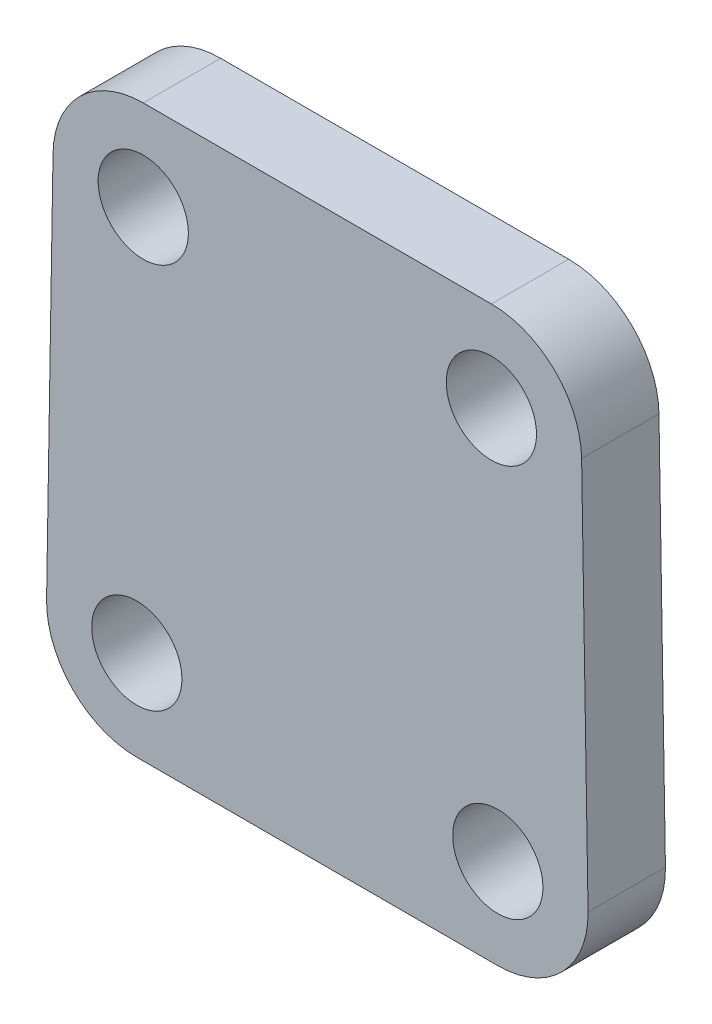
ISO-10303-21;
HEADER;
FILE_DESCRIPTION(('STEP AP214'),'2;1');
FILE_NAME('part.step','',(''),(''),'','','');
FILE_SCHEMA(('AUTOMOTIVE_DESIGN { 1 0 10303 214 1 1 1 1 }'));
ENDSEC;
DATA;
#1=APPLICATION_CONTEXT('core data for automotive mechanical design processes');
#2=APPLICATION_PROTOCOL_DEFINITION('international standard','automotive_design',2000,#1);
#3=PRODUCT_CONTEXT('',#1,'mechanical');
#4=PRODUCT('Part','Part','',(#3));
#5=PRODUCT_RELATED_PRODUCT_CATEGORY('part','',(#4));
#6=PRODUCT_DEFINITION_FORMATION('','',#4);
#7=PRODUCT_DEFINITION_CONTEXT('part definition',#1,'design');
#8=PRODUCT_DEFINITION('design','',#6,#7);
#9=PRODUCT_DEFINITION_SHAPE('','',#8);
#10=(LENGTH_UNIT() NAMED_UNIT(*) SI_UNIT(.MILLI.,.METRE.));
#11=(NAMED_UNIT(*) PLANE_ANGLE_UNIT() SI_UNIT($,.RADIAN.));
#12=(NAMED_UNIT(*) SI_UNIT($,.STERADIAN.) SOLID_ANGLE_UNIT());
#13=UNCERTAINTY_MEASURE_WITH_UNIT(LENGTH_MEASURE(1.E-05),#10,'distance_accuracy_value','');
#14=(GEOMETRIC_REPRESENTATION_CONTEXT(3) GLOBAL_UNCERTAINTY_ASSIGNED_CONTEXT((#13)) GLOBAL_UNIT_ASSIGNED_CONTEXT((#10,
#11,#12)) REPRESENTATION_CONTEXT('',''));
#15=CARTESIAN_POINT('',(0.,0.,0.));
#16=DIRECTION('',(0.,0.,1.));
#17=DIRECTION('',(1.,0.,0.));
#18=AXIS2_PLACEMENT_3D('',#15,#16,#17);
#19=CARTESIAN_POINT('',(0.,-7.3,3.));
#20=DIRECTION('',(0.,-1.,0.));
#21=DIRECTION('',(0.,0.,-1.));
#22=AXIS2_PLACEMENT_3D('',#19,#20,#21);
#23=PLANE('',#22);
#24=DIRECTION('',(-1.,0.,0.));
#25=VECTOR('',#24,1.);
#26=CARTESIAN_POINT('',(0.,-7.3,0.));
#27=LINE('',#26,#25);
#28=CARTESIAN_POINT('',(6.99952033899474,-7.3,0.));
#29=VERTEX_POINT('',#28);
#30=CARTESIAN_POINT('',(-6.99952033899473,-7.3,0.));
#31=VERTEX_POINT('',#30);
#32=EDGE_CURVE('E117',#29,#31,#27,.T.);
#33=ORIENTED_EDGE('',*,*,#32,.F.);
#34=DIRECTION('',(0.,0.,-1.));
#35=VECTOR('',#34,1.);
#36=CARTESIAN_POINT('',(6.99952033899474,-7.3,3.));
#37=LINE('',#36,#35);
#38=CARTESIAN_POINT('',(6.99952033899474,-7.3,3.));
#39=VERTEX_POINT('',#38);
#40=EDGE_CURVE('E11',#29,#39,#37,.F.);
#41=ORIENTED_EDGE('',*,*,#40,.T.);
#42=DIRECTION('',(-1.,0.,0.));
#43=VECTOR('',#42,1.);
#44=CARTESIAN_POINT('',(0.,-7.3,3.));
#45=LINE('',#44,#43);
#46=CARTESIAN_POINT('',(-6.99952033899473,-7.3,3.));
#47=VERTEX_POINT('',#46);
#48=EDGE_CURVE('E183',#39,#47,#45,.T.);
#49=ORIENTED_EDGE('',*,*,#48,.T.);
#50=DIRECTION('',(0.,0.,-1.));
#51=VECTOR('',#50,1.);
#52=CARTESIAN_POINT('',(-6.99952033899473,-7.3,3.));
#53=LINE('',#52,#51);
#54=EDGE_CURVE('E54',#47,#31,#53,.T.);
#55=ORIENTED_EDGE('',*,*,#54,.T.);
#56=EDGE_LOOP('',(#33,#41,#49,#55));
#57=FACE_BOUND('',#56,.T.);
#58=ADVANCED_FACE('F45',(#57),#23,.T.);
#59=CARTESIAN_POINT('',(10.4342259588508,0.172752085411436,3.));
#60=DIRECTION('',(0.999862972777529,0.0165540227281047,0.));
#61=DIRECTION('',(-0.0165540227281047,0.999862972777529,0.));
#62=AXIS2_PLACEMENT_3D('',#59,#60,#61);
#63=PLANE('',#62);
#64=DIRECTION('',(0.0165540227281047,-0.999862972777529,0.));
#65=VECTOR('',#64,1.);
#66=CARTESIAN_POINT('',(10.4342259588508,0.172752085411436,0.));
#67=LINE('',#66,#65);
#68=CARTESIAN_POINT('',(10.2490407437161,11.3579390795484,0.));
#69=VERTEX_POINT('',#68);
#70=CARTESIAN_POINT('',(10.4990407437161,-3.74206092045163,0.));
#71=VERTEX_POINT('',#70);
#72=EDGE_CURVE('E217',#69,#71,#67,.T.);
#73=ORIENTED_EDGE('',*,*,#72,.F.);
#74=DIRECTION('',(0.,0.,-1.));
#75=VECTOR('',#74,1.);
#76=CARTESIAN_POINT('',(10.2490407437161,11.3579390795484,3.));
#77=LINE('',#76,#75);
#78=CARTESIAN_POINT('',(10.2490407437161,11.3579390795484,3.));
#79=VERTEX_POINT('',#78);
#80=EDGE_CURVE('E68',#69,#79,#77,.F.);
#81=ORIENTED_EDGE('',*,*,#80,.T.);
#82=DIRECTION('',(0.0165540227281047,-0.999862972777529,0.));
#83=VECTOR('',#82,1.);
#84=CARTESIAN_POINT('',(10.4342259588508,0.172752085411436,3.));
#85=LINE('',#84,#83);
#86=CARTESIAN_POINT('',(10.4990407437161,-3.74206092045163,3.));
#87=VERTEX_POINT('',#86);
#88=EDGE_CURVE('E185',#79,#87,#85,.T.);
#89=ORIENTED_EDGE('',*,*,#88,.T.);
#90=DIRECTION('',(0.,0.,-1.));
#91=VECTOR('',#90,1.);
#92=CARTESIAN_POINT('',(10.4990407437161,-3.74206092045163,3.));
#93=LINE('',#92,#91);
#94=EDGE_CURVE('E174',#87,#71,#93,.T.);
#95=ORIENTED_EDGE('',*,*,#94,.T.);
#96=EDGE_LOOP('',(#73,#81,#89,#95));
#97=FACE_BOUND('',#96,.T.);
#98=ADVANCED_FACE('F245',(#97),#63,.T.);
#99=CARTESIAN_POINT('',(0.,14.8,3.));
#100=DIRECTION('',(0.,1.,0.));
#101=DIRECTION('',(0.,0.,1.));
#102=AXIS2_PLACEMENT_3D('',#99,#100,#101);
#103=PLANE('',#102);
#104=DIRECTION('',(1.,0.,0.));
#105=VECTOR('',#104,1.);
#106=CARTESIAN_POINT('',(0.,14.8,0.));
#107=LINE('',#106,#105);
#108=CARTESIAN_POINT('',(-6.74952033899473,14.8,0.));
#109=VERTEX_POINT('',#108);
#110=CARTESIAN_POINT('',(6.74952033899474,14.8,0.));
#111=VERTEX_POINT('',#110);
#112=EDGE_CURVE('E135',#109,#111,#107,.T.);
#113=ORIENTED_EDGE('',*,*,#112,.F.);
#114=DIRECTION('',(0.,0.,-1.));
#115=VECTOR('',#114,1.);
#116=CARTESIAN_POINT('',(-6.74952033899473,14.8,3.));
#117=LINE('',#116,#115);
#118=CARTESIAN_POINT('',(-6.74952033899473,14.8,3.));
#119=VERTEX_POINT('',#118);
#120=EDGE_CURVE('E161',#109,#119,#117,.F.);
#121=ORIENTED_EDGE('',*,*,#120,.T.);
#122=DIRECTION('',(1.,0.,0.));
#123=VECTOR('',#122,1.);
#124=CARTESIAN_POINT('',(0.,14.8,3.));
#125=LINE('',#124,#123);
#126=CARTESIAN_POINT('',(6.74952033899474,14.8,3.));
#127=VERTEX_POINT('',#126);
#128=EDGE_CURVE('E145',#119,#127,#125,.T.);
#129=ORIENTED_EDGE('',*,*,#128,.T.);
#130=DIRECTION('',(0.,0.,-1.));
#131=VECTOR('',#130,1.);
#132=CARTESIAN_POINT('',(6.74952033899474,14.8,3.));
#133=LINE('',#132,#131);
#134=EDGE_CURVE('E157',#127,#111,#133,.T.);
#135=ORIENTED_EDGE('',*,*,#134,.T.);
#136=EDGE_LOOP('',(#113,#121,#129,#135));
#137=FACE_BOUND('',#136,.T.);
#138=ADVANCED_FACE('F225',(#137),#103,.T.);
#139=CARTESIAN_POINT('',(-6.75,11.3,3.));
#140=DIRECTION('',(0.,0.,-1.));
#141=DIRECTION('',(-1.,0.,0.));
#142=AXIS2_PLACEMENT_3D('',#139,#140,#141);
#143=CYLINDRICAL_SURFACE('',#142,1.75);
#144=CARTESIAN_POINT('',(-6.75,11.3,3.));
#145=DIRECTION('',(0.,0.,1.));
#146=DIRECTION('',(1.,0.,0.));
#147=AXIS2_PLACEMENT_3D('',#144,#145,#146);
#148=CIRCLE('',#147,1.75);
#149=CARTESIAN_POINT('',(-5.,11.3,3.));
#150=VERTEX_POINT('',#149);
#151=EDGE_CURVE('E186',#150,#150,#148,.T.);
#152=ORIENTED_EDGE('',*,*,#151,.T.);
#153=EDGE_LOOP('',(#152));
#154=FACE_BOUND('',#153,.T.);
#155=CARTESIAN_POINT('',(-6.75,11.3,0.));
#156=DIRECTION('',(0.,0.,1.));
#157=DIRECTION('',(1.,0.,0.));
#158=AXIS2_PLACEMENT_3D('',#155,#156,#157);
#159=CIRCLE('',#158,1.75);
#160=CARTESIAN_POINT('',(-5.,11.3,0.));
#161=VERTEX_POINT('',#160);
#162=EDGE_CURVE('E211',#161,#161,#159,.T.);
#163=ORIENTED_EDGE('',*,*,#162,.F.);
#164=EDGE_LOOP('',(#163));
#165=FACE_BOUND('',#164,.T.);
#166=ADVANCED_FACE('F253',(#154,#165),#143,.F.);
#167=CARTESIAN_POINT('',(6.75,11.3,3.));
#168=DIRECTION('',(0.,0.,-1.));
#169=DIRECTION('',(-1.,0.,0.));
#170=AXIS2_PLACEMENT_3D('',#167,#168,#169);
#171=CYLINDRICAL_SURFACE('',#170,1.75);
#172=CARTESIAN_POINT('',(6.75,11.3,3.));
#173=DIRECTION('',(0.,0.,1.));
#174=DIRECTION('',(1.,0.,0.));
#175=AXIS2_PLACEMENT_3D('',#172,#173,#174);
#176=CIRCLE('',#175,1.75);
#177=CARTESIAN_POINT('',(8.5,11.3,3.));
#178=VERTEX_POINT('',#177);
#179=EDGE_CURVE('E192',#178,#178,#176,.T.);
#180=ORIENTED_EDGE('',*,*,#179,.T.);
#181=EDGE_LOOP('',(#180));
#182=FACE_BOUND('',#181,.T.);
#183=CARTESIAN_POINT('',(6.75,11.3,0.));
#184=DIRECTION('',(0.,0.,1.));
#185=DIRECTION('',(1.,0.,0.));
#186=AXIS2_PLACEMENT_3D('',#183,#184,#185);
#187=CIRCLE('',#186,1.75);
#188=CARTESIAN_POINT('',(8.5,11.3,0.));
#189=VERTEX_POINT('',#188);
#190=EDGE_CURVE('E207',#189,#189,#187,.T.);
#191=ORIENTED_EDGE('',*,*,#190,.F.);
#192=EDGE_LOOP('',(#191));
#193=FACE_BOUND('',#192,.T.);
#194=ADVANCED_FACE('F256',(#182,#193),#171,.F.);
#195=CARTESIAN_POINT('',(-7.,-3.8,3.));
#196=DIRECTION('',(0.,0.,-1.));
#197=DIRECTION('',(-1.,0.,0.));
#198=AXIS2_PLACEMENT_3D('',#195,#196,#197);
#199=CYLINDRICAL_SURFACE('',#198,1.75);
#200=CARTESIAN_POINT('',(-7.,-3.8,3.));
#201=DIRECTION('',(0.,0.,1.));
#202=DIRECTION('',(1.,0.,0.));
#203=AXIS2_PLACEMENT_3D('',#200,#201,#202);
#204=CIRCLE('',#203,1.75);
#205=CARTESIAN_POINT('',(-5.25,-3.8,3.));
#206=VERTEX_POINT('',#205);
#207=EDGE_CURVE('E403',#206,#206,#204,.T.);
#208=ORIENTED_EDGE('',*,*,#207,.T.);
#209=EDGE_LOOP('',(#208));
#210=FACE_BOUND('',#209,.T.);
#211=CARTESIAN_POINT('',(-7.,-3.8,0.));
#212=DIRECTION('',(0.,0.,1.));
#213=DIRECTION('',(1.,0.,0.));
#214=AXIS2_PLACEMENT_3D('',#211,#212,#213);
#215=CIRCLE('',#214,1.75);
#216=CARTESIAN_POINT('',(-5.25,-3.8,0.));
#217=VERTEX_POINT('',#216);
#218=EDGE_CURVE('E203',#217,#217,#215,.T.);
#219=ORIENTED_EDGE('',*,*,#218,.F.);
#220=EDGE_LOOP('',(#219));
#221=FACE_BOUND('',#220,.T.);
#222=ADVANCED_FACE('F260',(#210,#221),#199,.F.);
#223=CARTESIAN_POINT('',(7.,-3.8,3.));
#224=DIRECTION('',(0.,0.,-1.));
#225=DIRECTION('',(-1.,0.,0.));
#226=AXIS2_PLACEMENT_3D('',#223,#224,#225);
#227=CYLINDRICAL_SURFACE('',#226,1.75);
#228=CARTESIAN_POINT('',(7.,-3.8,3.));
#229=DIRECTION('',(0.,0.,1.));
#230=DIRECTION('',(1.,0.,0.));
#231=AXIS2_PLACEMENT_3D('',#228,#229,#230);
#232=CIRCLE('',#231,1.75);
#233=CARTESIAN_POINT('',(8.75,-3.8,3.));
#234=VERTEX_POINT('',#233);
#235=EDGE_CURVE('E134',#234,#234,#232,.T.);
#236=ORIENTED_EDGE('',*,*,#235,.T.);
#237=EDGE_LOOP('',(#236));
#238=FACE_BOUND('',#237,.T.);
#239=CARTESIAN_POINT('',(7.,-3.8,0.));
#240=DIRECTION('',(0.,0.,1.));
#241=DIRECTION('',(1.,0.,0.));
#242=AXIS2_PLACEMENT_3D('',#239,#240,#241);
#243=CIRCLE('',#242,1.75);
#244=CARTESIAN_POINT('',(8.75,-3.8,0.));
#245=VERTEX_POINT('',#244);
#246=EDGE_CURVE('E199',#245,#245,#243,.T.);
#247=ORIENTED_EDGE('',*,*,#246,.F.);
#248=EDGE_LOOP('',(#247));
#249=FACE_BOUND('',#248,.T.);
#250=ADVANCED_FACE('F264',(#238,#249),#227,.F.);
#251=CARTESIAN_POINT('',(-10.4342259588508,0.172752085411436,3.));
#252=DIRECTION('',(-0.999862972777529,0.0165540227281047,0.));
#253=DIRECTION('',(-0.0165540227281047,-0.999862972777529,0.));
#254=AXIS2_PLACEMENT_3D('',#251,#252,#253);
#255=PLANE('',#254);
#256=DIRECTION('',(0.0165540227281047,0.999862972777529,0.));
#257=VECTOR('',#256,1.);
#258=CARTESIAN_POINT('',(-10.4342259588508,0.172752085411436,3.));
#259=LINE('',#258,#257);
#260=CARTESIAN_POINT('',(-10.4990407437161,-3.74206092045163,3.));
#261=VERTEX_POINT('',#260);
#262=CARTESIAN_POINT('',(-10.2490407437161,11.3579390795484,3.));
#263=VERTEX_POINT('',#262);
#264=EDGE_CURVE('E140',#261,#263,#259,.T.);
#265=ORIENTED_EDGE('',*,*,#264,.T.);
#266=DIRECTION('',(0.,0.,-1.));
#267=VECTOR('',#266,1.);
#268=CARTESIAN_POINT('',(-10.2490407437161,11.3579390795484,3.));
#269=LINE('',#268,#267);
#270=CARTESIAN_POINT('',(-10.2490407437161,11.3579390795484,0.));
#271=VERTEX_POINT('',#270);
#272=EDGE_CURVE('E124',#263,#271,#269,.T.);
#273=ORIENTED_EDGE('',*,*,#272,.T.);
#274=DIRECTION('',(0.0165540227281047,0.999862972777529,0.));
#275=VECTOR('',#274,1.);
#276=CARTESIAN_POINT('',(-10.4342259588508,0.172752085411436,0.));
#277=LINE('',#276,#275);
#278=CARTESIAN_POINT('',(-10.4990407437161,-3.74206092045163,0.));
#279=VERTEX_POINT('',#278);
#280=EDGE_CURVE('E115',#279,#271,#277,.T.);
#281=ORIENTED_EDGE('',*,*,#280,.F.);
#282=DIRECTION('',(0.,0.,-1.));
#283=VECTOR('',#282,1.);
#284=CARTESIAN_POINT('',(-10.4990407437161,-3.74206092045163,3.));
#285=LINE('',#284,#283);
#286=EDGE_CURVE('E130',#279,#261,#285,.F.);
#287=ORIENTED_EDGE('',*,*,#286,.T.);
#288=EDGE_LOOP('',(#265,#273,#281,#287));
#289=FACE_BOUND('',#288,.T.);
#290=ADVANCED_FACE('F129',(#289),#255,.T.);
#291=CARTESIAN_POINT('',(0.,0.,3.));
#292=DIRECTION('',(0.,0.,1.));
#293=DIRECTION('',(1.,0.,0.));
#294=AXIS2_PLACEMENT_3D('',#291,#292,#293);
#295=PLANE('',#294);
#296=ORIENTED_EDGE('',*,*,#235,.F.);
#297=EDGE_LOOP('',(#296));
#298=FACE_BOUND('',#297,.T.);
#299=ORIENTED_EDGE('',*,*,#207,.F.);
#300=EDGE_LOOP('',(#299));
#301=FACE_BOUND('',#300,.T.);
#302=ORIENTED_EDGE('',*,*,#179,.F.);
#303=EDGE_LOOP('',(#302));
#304=FACE_BOUND('',#303,.T.);
#305=ORIENTED_EDGE('',*,*,#151,.F.);
#306=EDGE_LOOP('',(#305));
#307=FACE_BOUND('',#306,.T.);
#308=ORIENTED_EDGE('',*,*,#128,.F.);
#309=CARTESIAN_POINT('',(-6.74952033899473,11.3,3.));
#310=DIRECTION('',(0.,0.,1.));
#311=DIRECTION('',(1.,0.,0.));
#312=AXIS2_PLACEMENT_3D('',#309,#310,#311);
#313=CIRCLE('',#312,3.5);
#314=EDGE_CURVE('E171',#119,#263,#313,.T.);
#315=ORIENTED_EDGE('',*,*,#314,.T.);
#316=ORIENTED_EDGE('',*,*,#264,.F.);
#317=CARTESIAN_POINT('',(-6.99952033899473,-3.8,3.));
#318=DIRECTION('',(0.,0.,1.));
#319=DIRECTION('',(1.,0.,0.));
#320=AXIS2_PLACEMENT_3D('',#317,#318,#319);
#321=CIRCLE('',#320,3.5);
#322=EDGE_CURVE('E138',#261,#47,#321,.T.);
#323=ORIENTED_EDGE('',*,*,#322,.T.);
#324=ORIENTED_EDGE('',*,*,#48,.F.);
#325=CARTESIAN_POINT('',(6.99952033899474,-3.8,3.));
#326=DIRECTION('',(0.,0.,1.));
#327=DIRECTION('',(1.,0.,0.));
#328=AXIS2_PLACEMENT_3D('',#325,#326,#327);
#329=CIRCLE('',#328,3.5);
#330=EDGE_CURVE('E61',#39,#87,#329,.T.);
#331=ORIENTED_EDGE('',*,*,#330,.T.);
#332=ORIENTED_EDGE('',*,*,#88,.F.);
#333=CARTESIAN_POINT('',(6.74952033899474,11.3,3.));
#334=DIRECTION('',(0.,0.,1.));
#335=DIRECTION('',(1.,0.,0.));
#336=AXIS2_PLACEMENT_3D('',#333,#334,#335);
#337=CIRCLE('',#336,3.5);
#338=EDGE_CURVE('E168',#79,#127,#337,.T.);
#339=ORIENTED_EDGE('',*,*,#338,.T.);
#340=EDGE_LOOP('',(#308,#315,#316,#323,#324,#331,#332,#339));
#341=FACE_BOUND('',#340,.T.);
#342=ADVANCED_FACE('F231',(#298,#301,#304,#307,#341),#295,.T.);
#343=CARTESIAN_POINT('',(0.,0.,0.));
#344=DIRECTION('',(0.,0.,1.));
#345=DIRECTION('',(1.,0.,0.));
#346=AXIS2_PLACEMENT_3D('',#343,#344,#345);
#347=PLANE('',#346);
#348=ORIENTED_EDGE('',*,*,#246,.T.);
#349=EDGE_LOOP('',(#348));
#350=FACE_BOUND('',#349,.T.);
#351=ORIENTED_EDGE('',*,*,#218,.T.);
#352=EDGE_LOOP('',(#351));
#353=FACE_BOUND('',#352,.T.);
#354=ORIENTED_EDGE('',*,*,#190,.T.);
#355=EDGE_LOOP('',(#354));
#356=FACE_BOUND('',#355,.T.);
#357=ORIENTED_EDGE('',*,*,#162,.T.);
#358=EDGE_LOOP('',(#357));
#359=FACE_BOUND('',#358,.T.);
#360=ORIENTED_EDGE('',*,*,#280,.T.);
#361=CARTESIAN_POINT('',(-6.74952033899473,11.3,0.));
#362=DIRECTION('',(0.,0.,1.));
#363=DIRECTION('',(1.,0.,0.));
#364=AXIS2_PLACEMENT_3D('',#361,#362,#363);
#365=CIRCLE('',#364,3.5);
#366=EDGE_CURVE('E154',#271,#109,#365,.F.);
#367=ORIENTED_EDGE('',*,*,#366,.T.);
#368=ORIENTED_EDGE('',*,*,#112,.T.);
#369=CARTESIAN_POINT('',(6.74952033899474,11.3,0.));
#370=DIRECTION('',(0.,0.,1.));
#371=DIRECTION('',(1.,0.,0.));
#372=AXIS2_PLACEMENT_3D('',#369,#370,#371);
#373=CIRCLE('',#372,3.5);
#374=EDGE_CURVE('E151',#111,#69,#373,.F.);
#375=ORIENTED_EDGE('',*,*,#374,.T.);
#376=ORIENTED_EDGE('',*,*,#72,.T.);
#377=CARTESIAN_POINT('',(6.99952033899474,-3.8,0.));
#378=DIRECTION('',(0.,0.,1.));
#379=DIRECTION('',(1.,0.,0.));
#380=AXIS2_PLACEMENT_3D('',#377,#378,#379);
#381=CIRCLE('',#380,3.5);
#382=EDGE_CURVE('E123',#71,#29,#381,.F.);
#383=ORIENTED_EDGE('',*,*,#382,.T.);
#384=ORIENTED_EDGE('',*,*,#32,.T.);
#385=CARTESIAN_POINT('',(-6.99952033899473,-3.8,0.));
#386=DIRECTION('',(0.,0.,1.));
#387=DIRECTION('',(1.,0.,0.));
#388=AXIS2_PLACEMENT_3D('',#385,#386,#387);
#389=CIRCLE('',#388,3.5);
#390=EDGE_CURVE('E112',#31,#279,#389,.F.);
#391=ORIENTED_EDGE('',*,*,#390,.T.);
#392=EDGE_LOOP('',(#360,#367,#368,#375,#376,#383,#384,#391));
#393=FACE_BOUND('',#392,.T.);
#394=ADVANCED_FACE('F114',(#350,#353,#356,#359,#393),#347,.F.);
#395=CARTESIAN_POINT('',(-6.74952033899473,11.3,3.));
#396=DIRECTION('',(0.,0.,-1.));
#397=DIRECTION('',(-1.,0.,0.));
#398=AXIS2_PLACEMENT_3D('',#395,#396,#397);
#399=CYLINDRICAL_SURFACE('',#398,3.5);
#400=ORIENTED_EDGE('',*,*,#314,.F.);
#401=ORIENTED_EDGE('',*,*,#120,.F.);
#402=ORIENTED_EDGE('',*,*,#366,.F.);
#403=ORIENTED_EDGE('',*,*,#272,.F.);
#404=EDGE_LOOP('',(#400,#401,#402,#403));
#405=FACE_BOUND('',#404,.T.);
#406=ADVANCED_FACE('F230',(#405),#399,.T.);
#407=CARTESIAN_POINT('',(6.74952033899474,11.3,3.));
#408=DIRECTION('',(0.,0.,-1.));
#409=DIRECTION('',(-1.,0.,0.));
#410=AXIS2_PLACEMENT_3D('',#407,#408,#409);
#411=CYLINDRICAL_SURFACE('',#410,3.5);
#412=ORIENTED_EDGE('',*,*,#338,.F.);
#413=ORIENTED_EDGE('',*,*,#80,.F.);
#414=ORIENTED_EDGE('',*,*,#374,.F.);
#415=ORIENTED_EDGE('',*,*,#134,.F.);
#416=EDGE_LOOP('',(#412,#413,#414,#415));
#417=FACE_BOUND('',#416,.T.);
#418=ADVANCED_FACE('F234',(#417),#411,.T.);
#419=CARTESIAN_POINT('',(6.99952033899474,-3.8,3.));
#420=DIRECTION('',(0.,0.,-1.));
#421=DIRECTION('',(-1.,0.,0.));
#422=AXIS2_PLACEMENT_3D('',#419,#420,#421);
#423=CYLINDRICAL_SURFACE('',#422,3.5);
#424=ORIENTED_EDGE('',*,*,#330,.F.);
#425=ORIENTED_EDGE('',*,*,#40,.F.);
#426=ORIENTED_EDGE('',*,*,#382,.F.);
#427=ORIENTED_EDGE('',*,*,#94,.F.);
#428=EDGE_LOOP('',(#424,#425,#426,#427));
#429=FACE_BOUND('',#428,.T.);
#430=ADVANCED_FACE('F236',(#429),#423,.T.);
#431=CARTESIAN_POINT('',(-6.99952033899473,-3.8,3.));
#432=DIRECTION('',(0.,0.,-1.));
#433=DIRECTION('',(-1.,0.,0.));
#434=AXIS2_PLACEMENT_3D('',#431,#432,#433);
#435=CYLINDRICAL_SURFACE('',#434,3.5);
#436=ORIENTED_EDGE('',*,*,#322,.F.);
#437=ORIENTED_EDGE('',*,*,#286,.F.);
#438=ORIENTED_EDGE('',*,*,#390,.F.);
#439=ORIENTED_EDGE('',*,*,#54,.F.);
#440=EDGE_LOOP('',(#436,#437,#438,#439));
#441=FACE_BOUND('',#440,.T.);
#442=ADVANCED_FACE('F47',(#441),#435,.T.);
#443=CLOSED_SHELL('',(#58,#98,#138,#166,#194,#222,#250,#290,#342,#394,#406,#418,#430,#442));
#444=MANIFOLD_SOLID_BREP('B2',#443);
#445=ADVANCED_BREP_SHAPE_REPRESENTATION('',(#18,#444),#14);
#446=SHAPE_DEFINITION_REPRESENTATION(#9,#445);
ENDSEC;
END-ISO-10303-21;
